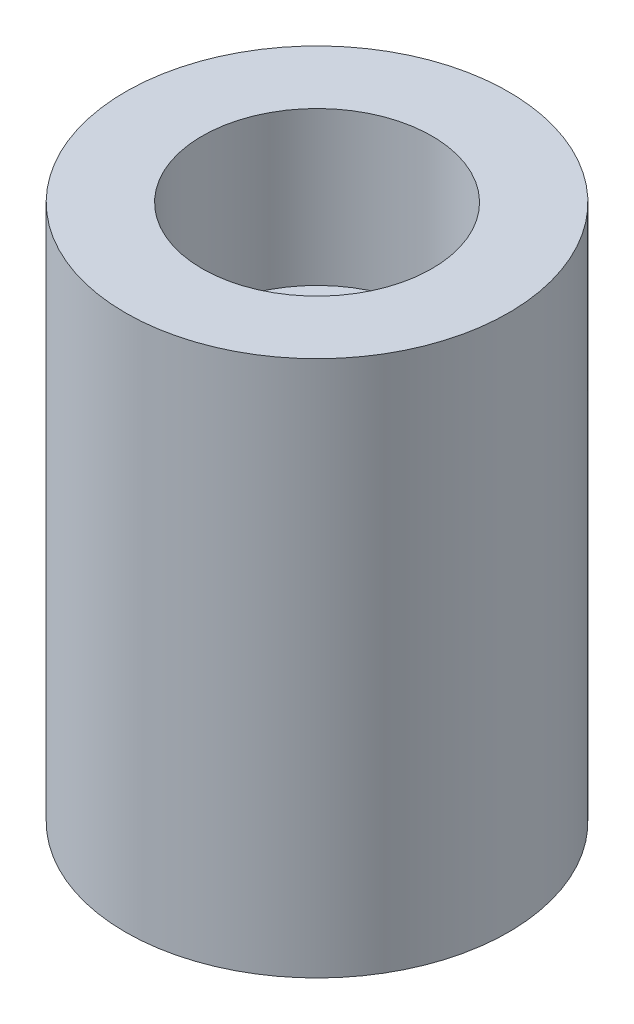
ISO-10303-21;
HEADER;
FILE_DESCRIPTION(('STEP AP214'),'2;1');
FILE_NAME('part.step','',(''),(''),'','','');
FILE_SCHEMA(('AUTOMOTIVE_DESIGN { 1 0 10303 214 1 1 1 1 }'));
ENDSEC;
DATA;
#1=APPLICATION_CONTEXT('core data for automotive mechanical design processes');
#2=APPLICATION_PROTOCOL_DEFINITION('international standard','automotive_design',2000,#1);
#3=PRODUCT_CONTEXT('',#1,'mechanical');
#4=PRODUCT('Part','Part','',(#3));
#5=PRODUCT_RELATED_PRODUCT_CATEGORY('part','',(#4));
#6=PRODUCT_DEFINITION_FORMATION('','',#4);
#7=PRODUCT_DEFINITION_CONTEXT('part definition',#1,'design');
#8=PRODUCT_DEFINITION('design','',#6,#7);
#9=PRODUCT_DEFINITION_SHAPE('','',#8);
#10=(LENGTH_UNIT() NAMED_UNIT(*) SI_UNIT(.MILLI.,.METRE.));
#11=(NAMED_UNIT(*) PLANE_ANGLE_UNIT() SI_UNIT($,.RADIAN.));
#12=(NAMED_UNIT(*) SI_UNIT($,.STERADIAN.) SOLID_ANGLE_UNIT());
#13=UNCERTAINTY_MEASURE_WITH_UNIT(LENGTH_MEASURE(1.E-05),#10,'distance_accuracy_value','');
#14=(GEOMETRIC_REPRESENTATION_CONTEXT(3) GLOBAL_UNCERTAINTY_ASSIGNED_CONTEXT((#13)) GLOBAL_UNIT_ASSIGNED_CONTEXT((#10,
#11,#12)) REPRESENTATION_CONTEXT('',''));
#15=CARTESIAN_POINT('',(0.,0.,0.));
#16=DIRECTION('',(0.,0.,1.));
#17=DIRECTION('',(1.,0.,0.));
#18=AXIS2_PLACEMENT_3D('',#15,#16,#17);
#19=CARTESIAN_POINT('',(0.,140.,0.));
#20=DIRECTION('',(0.,-1.,0.));
#21=DIRECTION('',(0.,0.,-1.));
#22=AXIS2_PLACEMENT_3D('',#19,#20,#21);
#23=CYLINDRICAL_SURFACE('',#22,50.);
#24=CARTESIAN_POINT('',(0.,140.,0.));
#25=DIRECTION('',(0.,1.,0.));
#26=DIRECTION('',(0.,0.,1.));
#27=AXIS2_PLACEMENT_3D('',#24,#25,#26);
#28=CIRCLE('',#27,50.);
#29=CARTESIAN_POINT('',(0.,140.,50.));
#30=VERTEX_POINT('',#29);
#31=EDGE_CURVE('E10',#30,#30,#28,.T.);
#32=ORIENTED_EDGE('',*,*,#31,.F.);
#33=EDGE_LOOP('',(#32));
#34=FACE_BOUND('',#33,.T.);
#35=CARTESIAN_POINT('',(0.,0.,0.));
#36=DIRECTION('',(0.,1.,0.));
#37=DIRECTION('',(0.,0.,1.));
#38=AXIS2_PLACEMENT_3D('',#35,#36,#37);
#39=CIRCLE('',#38,50.);
#40=CARTESIAN_POINT('',(0.,0.,50.));
#41=VERTEX_POINT('',#40);
#42=EDGE_CURVE('E34',#41,#41,#39,.T.);
#43=ORIENTED_EDGE('',*,*,#42,.T.);
#44=EDGE_LOOP('',(#43));
#45=FACE_BOUND('',#44,.T.);
#46=ADVANCED_FACE('F31',(#34,#45),#23,.T.);
#47=CARTESIAN_POINT('',(0.,140.,0.));
#48=DIRECTION('',(0.,1.,0.));
#49=DIRECTION('',(0.,0.,1.));
#50=AXIS2_PLACEMENT_3D('',#47,#48,#49);
#51=PLANE('',#50);
#52=CARTESIAN_POINT('',(0.,140.,0.));
#53=DIRECTION('',(0.,1.,0.));
#54=DIRECTION('',(0.,0.,1.));
#55=AXIS2_PLACEMENT_3D('',#52,#53,#54);
#56=CIRCLE('',#55,30.);
#57=CARTESIAN_POINT('',(0.,140.,30.));
#58=VERTEX_POINT('',#57);
#59=EDGE_CURVE('E43',#58,#58,#56,.T.);
#60=ORIENTED_EDGE('',*,*,#59,.F.);
#61=EDGE_LOOP('',(#60));
#62=FACE_BOUND('',#61,.T.);
#63=ORIENTED_EDGE('',*,*,#31,.T.);
#64=EDGE_LOOP('',(#63));
#65=FACE_BOUND('',#64,.T.);
#66=ADVANCED_FACE('F76',(#62,#65),#51,.T.);
#67=CARTESIAN_POINT('',(0.,0.,0.));
#68=DIRECTION('',(0.,1.,0.));
#69=DIRECTION('',(0.,0.,1.));
#70=AXIS2_PLACEMENT_3D('',#67,#68,#69);
#71=PLANE('',#70);
#72=ORIENTED_EDGE('',*,*,#42,.F.);
#73=EDGE_LOOP('',(#72));
#74=FACE_BOUND('',#73,.T.);
#75=ADVANCED_FACE('F72',(#74),#71,.F.);
#76=CARTESIAN_POINT('',(0.,100.,0.));
#77=DIRECTION('',(0.,1.,0.));
#78=DIRECTION('',(0.,0.,1.));
#79=AXIS2_PLACEMENT_3D('',#76,#77,#78);
#80=CYLINDRICAL_SURFACE('',#79,30.);
#81=CARTESIAN_POINT('',(0.,100.,0.));
#82=DIRECTION('',(0.,1.,0.));
#83=DIRECTION('',(0.,0.,1.));
#84=AXIS2_PLACEMENT_3D('',#81,#82,#83);
#85=CIRCLE('',#84,30.);
#86=CARTESIAN_POINT('',(0.,100.,30.));
#87=VERTEX_POINT('',#86);
#88=EDGE_CURVE('E41',#87,#87,#85,.T.);
#89=ORIENTED_EDGE('',*,*,#88,.F.);
#90=EDGE_LOOP('',(#89));
#91=FACE_BOUND('',#90,.T.);
#92=ORIENTED_EDGE('',*,*,#59,.T.);
#93=EDGE_LOOP('',(#92));
#94=FACE_BOUND('',#93,.T.);
#95=ADVANCED_FACE('F66',(#91,#94),#80,.F.);
#96=CARTESIAN_POINT('',(0.,100.,0.));
#97=DIRECTION('',(0.,1.,0.));
#98=DIRECTION('',(0.,0.,1.));
#99=AXIS2_PLACEMENT_3D('',#96,#97,#98);
#100=PLANE('',#99);
#101=CARTESIAN_POINT('',(0.,100.,0.));
#102=DIRECTION('',(0.,1.,0.));
#103=DIRECTION('',(0.,0.,1.));
#104=AXIS2_PLACEMENT_3D('',#101,#102,#103);
#105=CIRCLE('',#104,10.);
#106=CARTESIAN_POINT('',(0.,100.,10.));
#107=VERTEX_POINT('',#106);
#108=EDGE_CURVE('E49',#107,#107,#105,.T.);
#109=ORIENTED_EDGE('',*,*,#108,.F.);
#110=EDGE_LOOP('',(#109));
#111=FACE_BOUND('',#110,.T.);
#112=ORIENTED_EDGE('',*,*,#88,.T.);
#113=EDGE_LOOP('',(#112));
#114=FACE_BOUND('',#113,.T.);
#115=ADVANCED_FACE('F60',(#111,#114),#100,.T.);
#116=CARTESIAN_POINT('',(0.,20.,0.));
#117=DIRECTION('',(0.,1.,0.));
#118=DIRECTION('',(0.,0.,1.));
#119=AXIS2_PLACEMENT_3D('',#116,#117,#118);
#120=CYLINDRICAL_SURFACE('',#119,10.);
#121=CARTESIAN_POINT('',(0.,20.,0.));
#122=DIRECTION('',(0.,1.,0.));
#123=DIRECTION('',(0.,0.,1.));
#124=AXIS2_PLACEMENT_3D('',#121,#122,#123);
#125=CIRCLE('',#124,10.);
#126=CARTESIAN_POINT('',(0.,20.,10.));
#127=VERTEX_POINT('',#126);
#128=EDGE_CURVE('E46',#127,#127,#125,.T.);
#129=ORIENTED_EDGE('',*,*,#128,.F.);
#130=EDGE_LOOP('',(#129));
#131=FACE_BOUND('',#130,.T.);
#132=ORIENTED_EDGE('',*,*,#108,.T.);
#133=EDGE_LOOP('',(#132));
#134=FACE_BOUND('',#133,.T.);
#135=ADVANCED_FACE('F57',(#131,#134),#120,.F.);
#136=CARTESIAN_POINT('',(0.,20.,0.));
#137=DIRECTION('',(0.,1.,0.));
#138=DIRECTION('',(0.,0.,1.));
#139=AXIS2_PLACEMENT_3D('',#136,#137,#138);
#140=PLANE('',#139);
#141=ORIENTED_EDGE('',*,*,#128,.T.);
#142=EDGE_LOOP('',(#141));
#143=FACE_BOUND('',#142,.T.);
#144=ADVANCED_FACE('F55',(#143),#140,.T.);
#145=CLOSED_SHELL('',(#46,#66,#75,#95,#115,#135,#144));
#146=MANIFOLD_SOLID_BREP('B2',#145);
#147=ADVANCED_BREP_SHAPE_REPRESENTATION('',(#18,#146),#14);
#148=SHAPE_DEFINITION_REPRESENTATION(#9,#147);
ENDSEC;
END-ISO-10303-21;
